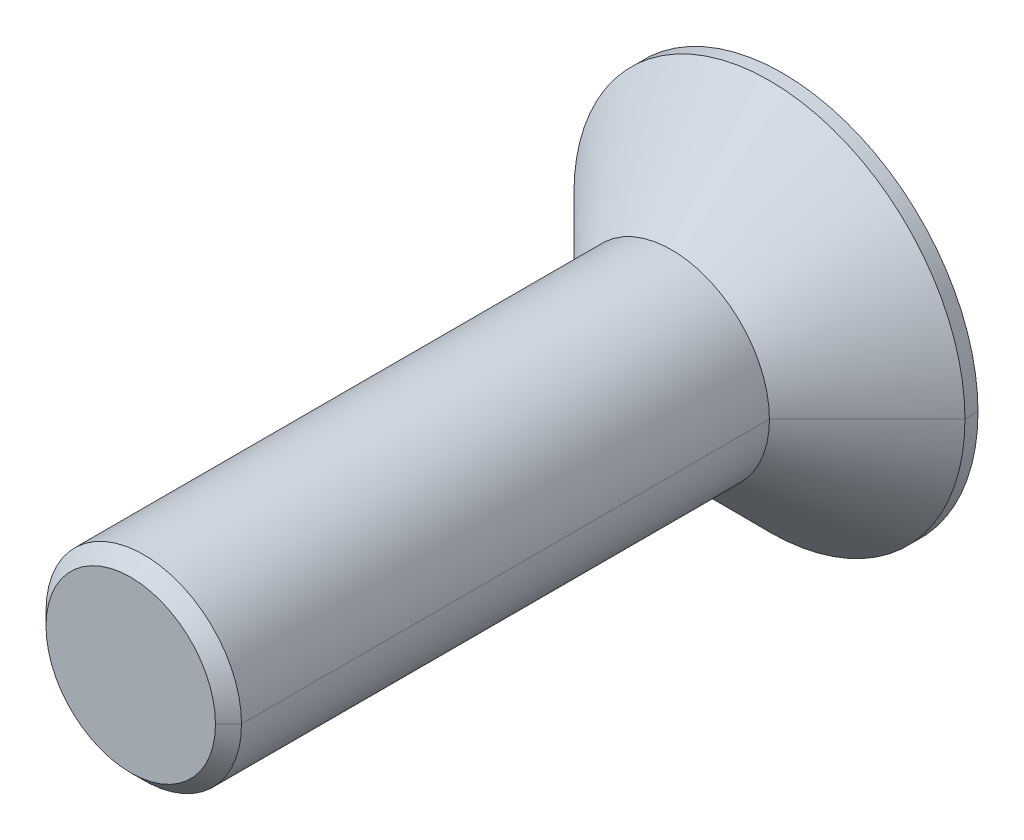
ISO-10303-21;
HEADER;
FILE_DESCRIPTION(('STEP AP214'),'2;1');
FILE_NAME('part.step','',(''),(''),'','','');
FILE_SCHEMA(('AUTOMOTIVE_DESIGN { 1 0 10303 214 1 1 1 1 }'));
ENDSEC;
DATA;
#1=APPLICATION_CONTEXT('core data for automotive mechanical design processes');
#2=APPLICATION_PROTOCOL_DEFINITION('international standard','automotive_design',2000,#1);
#3=PRODUCT_CONTEXT('',#1,'mechanical');
#4=PRODUCT('Part','Part','',(#3));
#5=PRODUCT_RELATED_PRODUCT_CATEGORY('part','',(#4));
#6=PRODUCT_DEFINITION_FORMATION('','',#4);
#7=PRODUCT_DEFINITION_CONTEXT('part definition',#1,'design');
#8=PRODUCT_DEFINITION('design','',#6,#7);
#9=PRODUCT_DEFINITION_SHAPE('','',#8);
#10=(LENGTH_UNIT() NAMED_UNIT(*) SI_UNIT(.MILLI.,.METRE.));
#11=(NAMED_UNIT(*) PLANE_ANGLE_UNIT() SI_UNIT($,.RADIAN.));
#12=(NAMED_UNIT(*) SI_UNIT($,.STERADIAN.) SOLID_ANGLE_UNIT());
#13=UNCERTAINTY_MEASURE_WITH_UNIT(LENGTH_MEASURE(1.E-05),#10,'distance_accuracy_value','');
#14=(GEOMETRIC_REPRESENTATION_CONTEXT(3) GLOBAL_UNCERTAINTY_ASSIGNED_CONTEXT((#13)) GLOBAL_UNIT_ASSIGNED_CONTEXT((#10,
#11,#12)) REPRESENTATION_CONTEXT('',''));
#15=CARTESIAN_POINT('',(0.,0.,0.));
#16=DIRECTION('',(0.,0.,1.));
#17=DIRECTION('',(1.,0.,0.));
#18=AXIS2_PLACEMENT_3D('',#15,#16,#17);
#19=CARTESIAN_POINT('',(0.,0.,-0.2));
#20=DIRECTION('',(0.,0.,-1.));
#21=DIRECTION('',(0.,-1.,0.));
#22=AXIS2_PLACEMENT_3D('',#19,#20,#21);
#23=PLANE('',#22);
#24=DIRECTION('',(-0.5,-0.866025403784439,0.));
#25=VECTOR('',#24,1.);
#26=CARTESIAN_POINT('',(1.15470053837925,0.,-0.2));
#27=LINE('',#26,#25);
#28=CARTESIAN_POINT('',(1.15470053837925,0.,-0.2));
#29=VERTEX_POINT('',#28);
#30=CARTESIAN_POINT('',(0.577350269189626,-1.,-0.2));
#31=VERTEX_POINT('',#30);
#32=EDGE_CURVE('E137',#29,#31,#27,.T.);
#33=ORIENTED_EDGE('',*,*,#32,.T.);
#34=DIRECTION('',(-1.,0.,0.));
#35=VECTOR('',#34,1.);
#36=CARTESIAN_POINT('',(0.577350269189626,-1.,-0.2));
#37=LINE('',#36,#35);
#38=CARTESIAN_POINT('',(-0.577350269189626,-1.,-0.2));
#39=VERTEX_POINT('',#38);
#40=EDGE_CURVE('E11',#31,#39,#37,.T.);
#41=ORIENTED_EDGE('',*,*,#40,.T.);
#42=DIRECTION('',(-0.5,0.866025403784439,0.));
#43=VECTOR('',#42,1.);
#44=CARTESIAN_POINT('',(-0.577350269189626,-1.,-0.2));
#45=LINE('',#44,#43);
#46=CARTESIAN_POINT('',(-1.15470053837925,0.,-0.2));
#47=VERTEX_POINT('',#46);
#48=EDGE_CURVE('E45',#39,#47,#45,.T.);
#49=ORIENTED_EDGE('',*,*,#48,.T.);
#50=DIRECTION('',(0.5,0.866025403784439,0.));
#51=VECTOR('',#50,1.);
#52=CARTESIAN_POINT('',(-1.15470053837925,0.,-0.2));
#53=LINE('',#52,#51);
#54=CARTESIAN_POINT('',(-0.577350269189627,1.,-0.2));
#55=VERTEX_POINT('',#54);
#56=EDGE_CURVE('E211',#47,#55,#53,.T.);
#57=ORIENTED_EDGE('',*,*,#56,.T.);
#58=DIRECTION('',(1.,0.,0.));
#59=VECTOR('',#58,1.);
#60=CARTESIAN_POINT('',(-0.577350269189627,1.,-0.2));
#61=LINE('',#60,#59);
#62=CARTESIAN_POINT('',(0.577350269189626,1.,-0.2));
#63=VERTEX_POINT('',#62);
#64=EDGE_CURVE('E205',#55,#63,#61,.T.);
#65=ORIENTED_EDGE('',*,*,#64,.T.);
#66=DIRECTION('',(0.5,-0.866025403784439,0.));
#67=VECTOR('',#66,1.);
#68=CARTESIAN_POINT('',(0.577350269189626,1.,-0.2));
#69=LINE('',#68,#67);
#70=EDGE_CURVE('E199',#63,#29,#69,.T.);
#71=ORIENTED_EDGE('',*,*,#70,.T.);
#72=EDGE_LOOP('',(#33,#41,#49,#57,#65,#71));
#73=FACE_BOUND('',#72,.T.);
#74=ADVANCED_FACE('F17',(#73),#23,.T.);
#75=CARTESIAN_POINT('',(0.577350269189626,-1.,-0.2));
#76=DIRECTION('',(0.,-1.,0.));
#77=DIRECTION('',(0.,0.,-1.));
#78=AXIS2_PLACEMENT_3D('',#75,#76,#77);
#79=PLANE('',#78);
#80=DIRECTION('',(-1.,0.,0.));
#81=VECTOR('',#80,1.);
#82=CARTESIAN_POINT('',(0.577350269189626,-1.,-1.7));
#83=LINE('',#82,#81);
#84=CARTESIAN_POINT('',(0.577350269189626,-1.,-1.7));
#85=VERTEX_POINT('',#84);
#86=CARTESIAN_POINT('',(-0.577350269189626,-1.,-1.7));
#87=VERTEX_POINT('',#86);
#88=EDGE_CURVE('E133',#85,#87,#83,.T.);
#89=ORIENTED_EDGE('',*,*,#88,.T.);
#90=DIRECTION('',(0.,0.,-1.));
#91=VECTOR('',#90,1.);
#92=CARTESIAN_POINT('',(-0.577350269189626,-1.,-0.2));
#93=LINE('',#92,#91);
#94=EDGE_CURVE('E20',#39,#87,#93,.T.);
#95=ORIENTED_EDGE('',*,*,#94,.F.);
#96=ORIENTED_EDGE('',*,*,#40,.F.);
#97=DIRECTION('',(0.,0.,-1.));
#98=VECTOR('',#97,1.);
#99=CARTESIAN_POINT('',(0.577350269189626,-1.,-0.2));
#100=LINE('',#99,#98);
#101=EDGE_CURVE('E129',#31,#85,#100,.T.);
#102=ORIENTED_EDGE('',*,*,#101,.T.);
#103=EDGE_LOOP('',(#89,#95,#96,#102));
#104=FACE_BOUND('',#103,.T.);
#105=ADVANCED_FACE('F131',(#104),#79,.F.);
#106=CARTESIAN_POINT('',(-0.577350269189626,-1.,-0.2));
#107=DIRECTION('',(-0.866025403784439,-0.5,0.));
#108=DIRECTION('',(-0.5,0.866025403784439,0.));
#109=AXIS2_PLACEMENT_3D('',#106,#107,#108);
#110=PLANE('',#109);
#111=DIRECTION('',(-0.5,0.866025403784439,0.));
#112=VECTOR('',#111,1.);
#113=CARTESIAN_POINT('',(-0.577350269189626,-1.,-1.7));
#114=LINE('',#113,#112);
#115=CARTESIAN_POINT('',(-1.15470053837925,0.,-1.7));
#116=VERTEX_POINT('',#115);
#117=EDGE_CURVE('E138',#87,#116,#114,.T.);
#118=ORIENTED_EDGE('',*,*,#117,.T.);
#119=DIRECTION('',(0.,0.,-1.));
#120=VECTOR('',#119,1.);
#121=CARTESIAN_POINT('',(-1.15470053837925,0.,-0.2));
#122=LINE('',#121,#120);
#123=EDGE_CURVE('E214',#47,#116,#122,.T.);
#124=ORIENTED_EDGE('',*,*,#123,.F.);
#125=ORIENTED_EDGE('',*,*,#48,.F.);
#126=ORIENTED_EDGE('',*,*,#94,.T.);
#127=EDGE_LOOP('',(#118,#124,#125,#126));
#128=FACE_BOUND('',#127,.T.);
#129=ADVANCED_FACE('F224',(#128),#110,.F.);
#130=CARTESIAN_POINT('',(-1.15470053837925,0.,-0.2));
#131=DIRECTION('',(-0.866025403784439,0.5,0.));
#132=DIRECTION('',(0.,0.,1.));
#133=AXIS2_PLACEMENT_3D('',#130,#131,#132);
#134=PLANE('',#133);
#135=DIRECTION('',(0.5,0.866025403784439,0.));
#136=VECTOR('',#135,1.);
#137=CARTESIAN_POINT('',(-1.15470053837925,0.,-1.7));
#138=LINE('',#137,#136);
#139=CARTESIAN_POINT('',(-0.577350269189627,1.,-1.7));
#140=VERTEX_POINT('',#139);
#141=EDGE_CURVE('E189',#116,#140,#138,.T.);
#142=ORIENTED_EDGE('',*,*,#141,.T.);
#143=DIRECTION('',(0.,0.,-1.));
#144=VECTOR('',#143,1.);
#145=CARTESIAN_POINT('',(-0.577350269189627,1.,-0.2));
#146=LINE('',#145,#144);
#147=EDGE_CURVE('E208',#55,#140,#146,.T.);
#148=ORIENTED_EDGE('',*,*,#147,.F.);
#149=ORIENTED_EDGE('',*,*,#56,.F.);
#150=ORIENTED_EDGE('',*,*,#123,.T.);
#151=EDGE_LOOP('',(#142,#148,#149,#150));
#152=FACE_BOUND('',#151,.T.);
#153=ADVANCED_FACE('F228',(#152),#134,.F.);
#154=CARTESIAN_POINT('',(-0.577350269189627,1.,-0.2));
#155=DIRECTION('',(0.,1.,0.));
#156=DIRECTION('',(1.,0.,0.));
#157=AXIS2_PLACEMENT_3D('',#154,#155,#156);
#158=PLANE('',#157);
#159=DIRECTION('',(1.,0.,0.));
#160=VECTOR('',#159,1.);
#161=CARTESIAN_POINT('',(-0.577350269189627,1.,-1.7));
#162=LINE('',#161,#160);
#163=CARTESIAN_POINT('',(0.577350269189626,1.,-1.7));
#164=VERTEX_POINT('',#163);
#165=EDGE_CURVE('E188',#140,#164,#162,.T.);
#166=ORIENTED_EDGE('',*,*,#165,.T.);
#167=DIRECTION('',(0.,0.,-1.));
#168=VECTOR('',#167,1.);
#169=CARTESIAN_POINT('',(0.577350269189626,1.,-0.2));
#170=LINE('',#169,#168);
#171=EDGE_CURVE('E202',#63,#164,#170,.T.);
#172=ORIENTED_EDGE('',*,*,#171,.F.);
#173=ORIENTED_EDGE('',*,*,#64,.F.);
#174=ORIENTED_EDGE('',*,*,#147,.T.);
#175=EDGE_LOOP('',(#166,#172,#173,#174));
#176=FACE_BOUND('',#175,.T.);
#177=ADVANCED_FACE('F234',(#176),#158,.F.);
#178=CARTESIAN_POINT('',(0.577350269189626,1.,-0.2));
#179=DIRECTION('',(0.866025403784439,0.5,0.));
#180=DIRECTION('',(0.,0.,-1.));
#181=AXIS2_PLACEMENT_3D('',#178,#179,#180);
#182=PLANE('',#181);
#183=DIRECTION('',(0.5,-0.866025403784439,0.));
#184=VECTOR('',#183,1.);
#185=CARTESIAN_POINT('',(0.577350269189626,1.,-1.7));
#186=LINE('',#185,#184);
#187=CARTESIAN_POINT('',(1.15470053837925,0.,-1.7));
#188=VERTEX_POINT('',#187);
#189=EDGE_CURVE('E149',#164,#188,#186,.T.);
#190=ORIENTED_EDGE('',*,*,#189,.T.);
#191=DIRECTION('',(0.,0.,-1.));
#192=VECTOR('',#191,1.);
#193=CARTESIAN_POINT('',(1.15470053837925,0.,-0.2));
#194=LINE('',#193,#192);
#195=EDGE_CURVE('E144',#29,#188,#194,.T.);
#196=ORIENTED_EDGE('',*,*,#195,.F.);
#197=ORIENTED_EDGE('',*,*,#70,.F.);
#198=ORIENTED_EDGE('',*,*,#171,.T.);
#199=EDGE_LOOP('',(#190,#196,#197,#198));
#200=FACE_BOUND('',#199,.T.);
#201=ADVANCED_FACE('F237',(#200),#182,.F.);
#202=CARTESIAN_POINT('',(1.15470053837925,0.,-0.2));
#203=DIRECTION('',(0.866025403784439,-0.5,0.));
#204=DIRECTION('',(0.,0.,-1.));
#205=AXIS2_PLACEMENT_3D('',#202,#203,#204);
#206=PLANE('',#205);
#207=DIRECTION('',(-0.5,-0.866025403784439,0.));
#208=VECTOR('',#207,1.);
#209=CARTESIAN_POINT('',(1.15470053837925,0.,-1.7));
#210=LINE('',#209,#208);
#211=EDGE_CURVE('E141',#188,#85,#210,.T.);
#212=ORIENTED_EDGE('',*,*,#211,.T.);
#213=ORIENTED_EDGE('',*,*,#101,.F.);
#214=ORIENTED_EDGE('',*,*,#32,.F.);
#215=ORIENTED_EDGE('',*,*,#195,.T.);
#216=EDGE_LOOP('',(#212,#213,#214,#215));
#217=FACE_BOUND('',#216,.T.);
#218=ADVANCED_FACE('F142',(#217),#206,.F.);
#219=CARTESIAN_POINT('',(0.,0.,8.3));
#220=DIRECTION('',(0.,0.,-1.));
#221=DIRECTION('',(-1.,0.,0.));
#222=AXIS2_PLACEMENT_3D('',#219,#220,#221);
#223=CONICAL_SURFACE('',#222,1.3,0.785398163397446);
#224=DIRECTION('',(0.707106781186546,0.,-0.707106781186549));
#225=VECTOR('',#224,1.);
#226=CARTESIAN_POINT('',(1.3,0.,8.3));
#227=LINE('',#226,#225);
#228=CARTESIAN_POINT('',(1.3,0.,8.3));
#229=VERTEX_POINT('',#228);
#230=CARTESIAN_POINT('',(1.5,0.,8.1));
#231=VERTEX_POINT('',#230);
#232=EDGE_CURVE('E307',#229,#231,#227,.T.);
#233=ORIENTED_EDGE('',*,*,#232,.F.);
#234=CARTESIAN_POINT('',(0.,0.,8.3));
#235=DIRECTION('',(0.,0.,1.));
#236=DIRECTION('',(1.,0.,0.));
#237=AXIS2_PLACEMENT_3D('',#234,#235,#236);
#238=CIRCLE('',#237,1.3);
#239=CARTESIAN_POINT('',(-1.3,0.,8.3));
#240=VERTEX_POINT('',#239);
#241=EDGE_CURVE('E164',#240,#229,#238,.T.);
#242=ORIENTED_EDGE('',*,*,#241,.F.);
#243=DIRECTION('',(-0.707106781186546,0.,-0.707106781186549));
#244=VECTOR('',#243,1.);
#245=CARTESIAN_POINT('',(-1.3,0.,8.3));
#246=LINE('',#245,#244);
#247=CARTESIAN_POINT('',(-1.5,0.,8.1));
#248=VERTEX_POINT('',#247);
#249=EDGE_CURVE('E248',#240,#248,#246,.T.);
#250=ORIENTED_EDGE('',*,*,#249,.T.);
#251=CARTESIAN_POINT('',(0.,0.,8.1));
#252=DIRECTION('',(0.,0.,-1.));
#253=DIRECTION('',(1.,0.,0.));
#254=AXIS2_PLACEMENT_3D('',#251,#252,#253);
#255=CIRCLE('',#254,1.5);
#256=EDGE_CURVE('E179',#231,#248,#255,.T.);
#257=ORIENTED_EDGE('',*,*,#256,.F.);
#258=EDGE_LOOP('',(#233,#242,#250,#257));
#259=FACE_BOUND('',#258,.T.);
#260=ADVANCED_FACE('F324',(#259),#223,.T.);
#261=CARTESIAN_POINT('',(0.,0.,-1.7));
#262=DIRECTION('',(0.,0.,1.));
#263=DIRECTION('',(1.,0.,0.));
#264=AXIS2_PLACEMENT_3D('',#261,#262,#263);
#265=PLANE('',#264);
#266=ORIENTED_EDGE('',*,*,#88,.F.);
#267=ORIENTED_EDGE('',*,*,#211,.F.);
#268=ORIENTED_EDGE('',*,*,#189,.F.);
#269=ORIENTED_EDGE('',*,*,#165,.F.);
#270=ORIENTED_EDGE('',*,*,#141,.F.);
#271=ORIENTED_EDGE('',*,*,#117,.F.);
#272=EDGE_LOOP('',(#266,#267,#268,#269,#270,#271));
#273=FACE_BOUND('',#272,.T.);
#274=CARTESIAN_POINT('',(0.,0.,-1.7));
#275=DIRECTION('',(0.,0.,-1.));
#276=DIRECTION('',(-1.,0.,0.));
#277=AXIS2_PLACEMENT_3D('',#274,#275,#276);
#278=CIRCLE('',#277,3.);
#279=CARTESIAN_POINT('',(-3.,0.,-1.7));
#280=VERTEX_POINT('',#279);
#281=CARTESIAN_POINT('',(3.,0.,-1.7));
#282=VERTEX_POINT('',#281);
#283=EDGE_CURVE('E259',#280,#282,#278,.T.);
#284=ORIENTED_EDGE('',*,*,#283,.T.);
#285=CARTESIAN_POINT('',(0.,0.,-1.7));
#286=DIRECTION('',(0.,0.,-1.));
#287=DIRECTION('',(-1.,0.,0.));
#288=AXIS2_PLACEMENT_3D('',#285,#286,#287);
#289=CIRCLE('',#288,3.);
#290=EDGE_CURVE('E157',#282,#280,#289,.T.);
#291=ORIENTED_EDGE('',*,*,#290,.T.);
#292=EDGE_LOOP('',(#284,#291));
#293=FACE_BOUND('',#292,.T.);
#294=ADVANCED_FACE('F152',(#273,#293),#265,.F.);
#295=CARTESIAN_POINT('',(0.,0.,8.3));
#296=DIRECTION('',(0.,0.,-1.));
#297=DIRECTION('',(-1.,0.,0.));
#298=AXIS2_PLACEMENT_3D('',#295,#296,#297);
#299=CYLINDRICAL_SURFACE('',#298,3.);
#300=DIRECTION('',(0.,0.,-1.));
#301=VECTOR('',#300,1.);
#302=CARTESIAN_POINT('',(3.,0.,8.3));
#303=LINE('',#302,#301);
#304=CARTESIAN_POINT('',(3.,0.,-1.5));
#305=VERTEX_POINT('',#304);
#306=EDGE_CURVE('E255',#305,#282,#303,.T.);
#307=ORIENTED_EDGE('',*,*,#306,.F.);
#308=CARTESIAN_POINT('',(0.,0.,-1.5));
#309=DIRECTION('',(0.,0.,1.));
#310=DIRECTION('',(-1.,0.,0.));
#311=AXIS2_PLACEMENT_3D('',#308,#309,#310);
#312=CIRCLE('',#311,3.);
#313=CARTESIAN_POINT('',(-3.,0.,-1.5));
#314=VERTEX_POINT('',#313);
#315=EDGE_CURVE('E170',#314,#305,#312,.T.);
#316=ORIENTED_EDGE('',*,*,#315,.F.);
#317=DIRECTION('',(0.,0.,-1.));
#318=VECTOR('',#317,1.);
#319=CARTESIAN_POINT('',(-3.,0.,8.3));
#320=LINE('',#319,#318);
#321=EDGE_CURVE('E265',#314,#280,#320,.T.);
#322=ORIENTED_EDGE('',*,*,#321,.T.);
#323=ORIENTED_EDGE('',*,*,#290,.F.);
#324=EDGE_LOOP('',(#307,#316,#322,#323));
#325=FACE_BOUND('',#324,.T.);
#326=ADVANCED_FACE('F293',(#325),#299,.T.);
#327=CARTESIAN_POINT('',(0.,0.,8.3));
#328=DIRECTION('',(0.,0.,1.));
#329=DIRECTION('',(1.,0.,0.));
#330=AXIS2_PLACEMENT_3D('',#327,#328,#329);
#331=PLANE('',#330);
#332=ORIENTED_EDGE('',*,*,#241,.T.);
#333=CARTESIAN_POINT('',(0.,0.,8.3));
#334=DIRECTION('',(0.,0.,1.));
#335=DIRECTION('',(1.,0.,0.));
#336=AXIS2_PLACEMENT_3D('',#333,#334,#335);
#337=CIRCLE('',#336,1.3);
#338=EDGE_CURVE('E306',#229,#240,#337,.T.);
#339=ORIENTED_EDGE('',*,*,#338,.T.);
#340=EDGE_LOOP('',(#332,#339));
#341=FACE_BOUND('',#340,.T.);
#342=ADVANCED_FACE('F320',(#341),#331,.T.);
#343=CARTESIAN_POINT('',(0.,0.,8.3));
#344=DIRECTION('',(0.,0.,-1.));
#345=DIRECTION('',(-1.,0.,0.));
#346=AXIS2_PLACEMENT_3D('',#343,#344,#345);
#347=CYLINDRICAL_SURFACE('',#346,1.5);
#348=DIRECTION('',(0.,0.,-1.));
#349=VECTOR('',#348,1.);
#350=CARTESIAN_POINT('',(1.5,0.,8.3));
#351=LINE('',#350,#349);
#352=CARTESIAN_POINT('',(1.5,0.,0.));
#353=VERTEX_POINT('',#352);
#354=EDGE_CURVE('E260',#231,#353,#351,.T.);
#355=ORIENTED_EDGE('',*,*,#354,.F.);
#356=ORIENTED_EDGE('',*,*,#256,.T.);
#357=DIRECTION('',(0.,0.,-1.));
#358=VECTOR('',#357,1.);
#359=CARTESIAN_POINT('',(-1.5,0.,8.3));
#360=LINE('',#359,#358);
#361=CARTESIAN_POINT('',(-1.5,0.,0.));
#362=VERTEX_POINT('',#361);
#363=EDGE_CURVE('E168',#248,#362,#360,.T.);
#364=ORIENTED_EDGE('',*,*,#363,.T.);
#365=CARTESIAN_POINT('',(0.,0.,0.));
#366=DIRECTION('',(0.,0.,1.));
#367=DIRECTION('',(1.,0.,0.));
#368=AXIS2_PLACEMENT_3D('',#365,#366,#367);
#369=CIRCLE('',#368,1.5);
#370=EDGE_CURVE('E178',#362,#353,#369,.T.);
#371=ORIENTED_EDGE('',*,*,#370,.T.);
#372=EDGE_LOOP('',(#355,#356,#364,#371));
#373=FACE_BOUND('',#372,.T.);
#374=ADVANCED_FACE('F280',(#373),#347,.T.);
#375=CARTESIAN_POINT('',(0.,0.,0.));
#376=DIRECTION('',(0.,0.,-1.));
#377=DIRECTION('',(1.,0.,0.));
#378=AXIS2_PLACEMENT_3D('',#375,#376,#377);
#379=CONICAL_SURFACE('',#378,1.5,0.78539816339745);
#380=DIRECTION('',(-0.707106781186549,0.,-0.707106781186546));
#381=VECTOR('',#380,1.);
#382=CARTESIAN_POINT('',(-1.5,0.,0.));
#383=LINE('',#382,#381);
#384=EDGE_CURVE('E174',#362,#314,#383,.T.);
#385=ORIENTED_EDGE('',*,*,#384,.F.);
#386=CARTESIAN_POINT('',(0.,0.,0.));
#387=DIRECTION('',(0.,0.,1.));
#388=DIRECTION('',(1.,0.,0.));
#389=AXIS2_PLACEMENT_3D('',#386,#387,#388);
#390=CIRCLE('',#389,1.5);
#391=EDGE_CURVE('E264',#353,#362,#390,.T.);
#392=ORIENTED_EDGE('',*,*,#391,.F.);
#393=DIRECTION('',(0.707106781186549,0.,-0.707106781186546));
#394=VECTOR('',#393,1.);
#395=CARTESIAN_POINT('',(1.5,0.,0.));
#396=LINE('',#395,#394);
#397=EDGE_CURVE('E173',#353,#305,#396,.T.);
#398=ORIENTED_EDGE('',*,*,#397,.T.);
#399=CARTESIAN_POINT('',(0.,0.,-1.5));
#400=DIRECTION('',(0.,0.,1.));
#401=DIRECTION('',(-1.,0.,0.));
#402=AXIS2_PLACEMENT_3D('',#399,#400,#401);
#403=CIRCLE('',#402,3.);
#404=EDGE_CURVE('E250',#305,#314,#403,.T.);
#405=ORIENTED_EDGE('',*,*,#404,.T.);
#406=EDGE_LOOP('',(#385,#392,#398,#405));
#407=FACE_BOUND('',#406,.T.);
#408=ADVANCED_FACE('F285',(#407),#379,.T.);
#409=CARTESIAN_POINT('',(0.,0.,0.));
#410=DIRECTION('',(0.,0.,-1.));
#411=DIRECTION('',(1.,0.,0.));
#412=AXIS2_PLACEMENT_3D('',#409,#410,#411);
#413=CONICAL_SURFACE('',#412,1.5,0.78539816339745);
#414=ORIENTED_EDGE('',*,*,#370,.F.);
#415=ORIENTED_EDGE('',*,*,#384,.T.);
#416=ORIENTED_EDGE('',*,*,#315,.T.);
#417=ORIENTED_EDGE('',*,*,#397,.F.);
#418=EDGE_LOOP('',(#414,#415,#416,#417));
#419=FACE_BOUND('',#418,.T.);
#420=ADVANCED_FACE('F289',(#419),#413,.T.);
#421=CARTESIAN_POINT('',(0.,0.,8.3));
#422=DIRECTION('',(0.,0.,-1.));
#423=DIRECTION('',(-1.,0.,0.));
#424=AXIS2_PLACEMENT_3D('',#421,#422,#423);
#425=CYLINDRICAL_SURFACE('',#424,1.5);
#426=CARTESIAN_POINT('',(0.,0.,8.1));
#427=DIRECTION('',(0.,0.,-1.));
#428=DIRECTION('',(1.,0.,0.));
#429=AXIS2_PLACEMENT_3D('',#426,#427,#428);
#430=CIRCLE('',#429,1.5);
#431=EDGE_CURVE('E246',#248,#231,#430,.T.);
#432=ORIENTED_EDGE('',*,*,#431,.T.);
#433=ORIENTED_EDGE('',*,*,#354,.T.);
#434=ORIENTED_EDGE('',*,*,#391,.T.);
#435=ORIENTED_EDGE('',*,*,#363,.F.);
#436=EDGE_LOOP('',(#432,#433,#434,#435));
#437=FACE_BOUND('',#436,.T.);
#438=ADVANCED_FACE('F283',(#437),#425,.T.);
#439=CARTESIAN_POINT('',(0.,0.,8.3));
#440=DIRECTION('',(0.,0.,-1.));
#441=DIRECTION('',(-1.,0.,0.));
#442=AXIS2_PLACEMENT_3D('',#439,#440,#441);
#443=CYLINDRICAL_SURFACE('',#442,3.);
#444=ORIENTED_EDGE('',*,*,#404,.F.);
#445=ORIENTED_EDGE('',*,*,#306,.T.);
#446=ORIENTED_EDGE('',*,*,#283,.F.);
#447=ORIENTED_EDGE('',*,*,#321,.F.);
#448=EDGE_LOOP('',(#444,#445,#446,#447));
#449=FACE_BOUND('',#448,.T.);
#450=ADVANCED_FACE('F297',(#449),#443,.T.);
#451=CARTESIAN_POINT('',(0.,0.,8.3));
#452=DIRECTION('',(0.,0.,-1.));
#453=DIRECTION('',(-1.,0.,0.));
#454=AXIS2_PLACEMENT_3D('',#451,#452,#453);
#455=CONICAL_SURFACE('',#454,1.3,0.785398163397446);
#456=ORIENTED_EDGE('',*,*,#338,.F.);
#457=ORIENTED_EDGE('',*,*,#232,.T.);
#458=ORIENTED_EDGE('',*,*,#431,.F.);
#459=ORIENTED_EDGE('',*,*,#249,.F.);
#460=EDGE_LOOP('',(#456,#457,#458,#459));
#461=FACE_BOUND('',#460,.T.);
#462=ADVANCED_FACE('F322',(#461),#455,.T.);
#463=CLOSED_SHELL('',(#74,#105,#129,#153,#177,#201,#218,#260,#294,#326,#342,#374,#408,#420,#438,
#450,#462));
#464=MANIFOLD_SOLID_BREP('B1',#463);
#465=ADVANCED_BREP_SHAPE_REPRESENTATION('',(#18,#464),#14);
#466=SHAPE_DEFINITION_REPRESENTATION(#9,#465);
ENDSEC;
END-ISO-10303-21;
